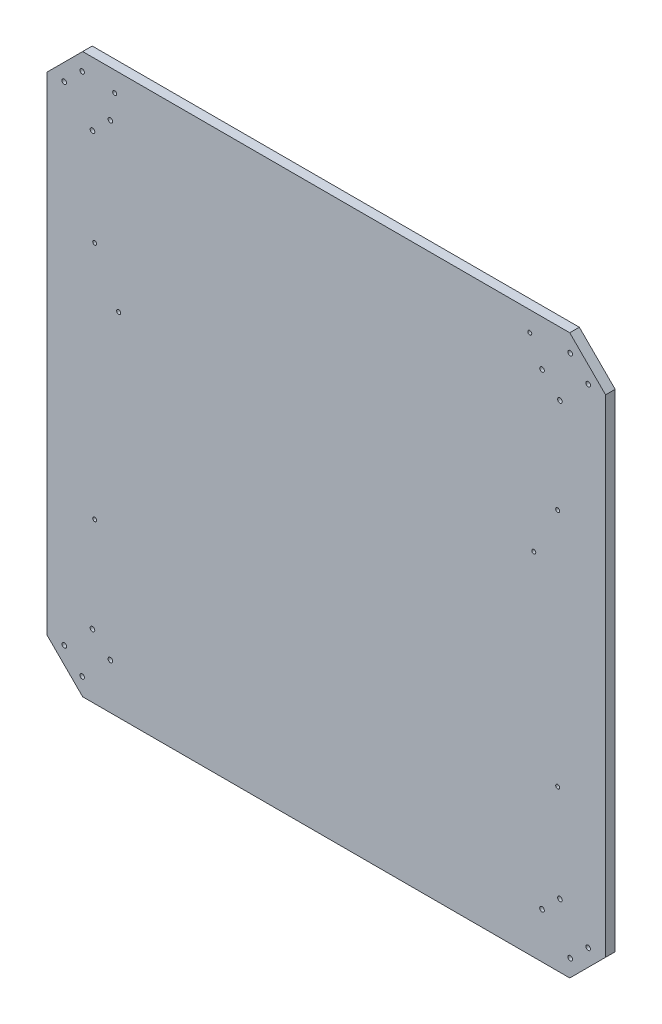
ISO-10303-21;
HEADER;
FILE_DESCRIPTION(('STEP AP214'),'2;1');
FILE_NAME('part.step','',(''),(''),'','','');
FILE_SCHEMA(('AUTOMOTIVE_DESIGN { 1 0 10303 214 1 1 1 1 }'));
ENDSEC;
DATA;
#1=APPLICATION_CONTEXT('core data for automotive mechanical design processes');
#2=APPLICATION_PROTOCOL_DEFINITION('international standard','automotive_design',2000,#1);
#3=PRODUCT_CONTEXT('',#1,'mechanical');
#4=PRODUCT('Part','Part','',(#3));
#5=PRODUCT_RELATED_PRODUCT_CATEGORY('part','',(#4));
#6=PRODUCT_DEFINITION_FORMATION('','',#4);
#7=PRODUCT_DEFINITION_CONTEXT('part definition',#1,'design');
#8=PRODUCT_DEFINITION('design','',#6,#7);
#9=PRODUCT_DEFINITION_SHAPE('','',#8);
#10=(LENGTH_UNIT() NAMED_UNIT(*) SI_UNIT(.MILLI.,.METRE.));
#11=(NAMED_UNIT(*) PLANE_ANGLE_UNIT() SI_UNIT($,.RADIAN.));
#12=(NAMED_UNIT(*) SI_UNIT($,.STERADIAN.) SOLID_ANGLE_UNIT());
#13=UNCERTAINTY_MEASURE_WITH_UNIT(LENGTH_MEASURE(1.E-05),#10,'distance_accuracy_value','');
#14=(GEOMETRIC_REPRESENTATION_CONTEXT(3) GLOBAL_UNCERTAINTY_ASSIGNED_CONTEXT((#13)) GLOBAL_UNIT_ASSIGNED_CONTEXT((#10,
#11,#12)) REPRESENTATION_CONTEXT('',''));
#15=CARTESIAN_POINT('',(0.,0.,0.));
#16=DIRECTION('',(0.,0.,1.));
#17=DIRECTION('',(1.,0.,0.));
#18=AXIS2_PLACEMENT_3D('',#15,#16,#17);
#19=CARTESIAN_POINT('',(350.,-350.,12.));
#20=DIRECTION('',(-1.,0.,0.));
#21=DIRECTION('',(0.,0.,1.));
#22=AXIS2_PLACEMENT_3D('',#19,#20,#21);
#23=PLANE('',#22);
#24=DIRECTION('',(0.,1.,0.));
#25=VECTOR('',#24,1.);
#26=CARTESIAN_POINT('',(350.,-350.,12.));
#27=LINE('',#26,#25);
#28=CARTESIAN_POINT('',(350.,-305.098719394654,12.));
#29=VERTEX_POINT('',#28);
#30=CARTESIAN_POINT('',(350.,305.098719394654,12.));
#31=VERTEX_POINT('',#30);
#32=EDGE_CURVE('E138',#29,#31,#27,.T.);
#33=ORIENTED_EDGE('',*,*,#32,.F.);
#34=DIRECTION('',(0.,0.,1.));
#35=VECTOR('',#34,1.);
#36=CARTESIAN_POINT('',(350.,-305.098719394654,0.));
#37=LINE('',#36,#35);
#38=CARTESIAN_POINT('',(350.,-305.098719394654,0.));
#39=VERTEX_POINT('',#38);
#40=EDGE_CURVE('E263',#39,#29,#37,.T.);
#41=ORIENTED_EDGE('',*,*,#40,.F.);
#42=DIRECTION('',(0.,1.,0.));
#43=VECTOR('',#42,1.);
#44=CARTESIAN_POINT('',(350.,-350.,0.));
#45=LINE('',#44,#43);
#46=CARTESIAN_POINT('',(350.,305.098719394654,0.));
#47=VERTEX_POINT('',#46);
#48=EDGE_CURVE('E288',#39,#47,#45,.T.);
#49=ORIENTED_EDGE('',*,*,#48,.T.);
#50=DIRECTION('',(0.,0.,1.));
#51=VECTOR('',#50,1.);
#52=CARTESIAN_POINT('',(350.,305.098719394654,0.));
#53=LINE('',#52,#51);
#54=EDGE_CURVE('E285',#47,#31,#53,.T.);
#55=ORIENTED_EDGE('',*,*,#54,.T.);
#56=EDGE_LOOP('',(#33,#41,#49,#55));
#57=FACE_BOUND('',#56,.T.);
#58=ADVANCED_FACE('F52',(#57),#23,.F.);
#59=CARTESIAN_POINT('',(-350.,350.,12.));
#60=DIRECTION('',(0.,-1.,0.));
#61=DIRECTION('',(0.,0.,-1.));
#62=AXIS2_PLACEMENT_3D('',#59,#60,#61);
#63=PLANE('',#62);
#64=DIRECTION('',(-1.,0.,0.));
#65=VECTOR('',#64,1.);
#66=CARTESIAN_POINT('',(-350.,350.,0.));
#67=LINE('',#66,#65);
#68=CARTESIAN_POINT('',(305.098719394654,350.,0.));
#69=VERTEX_POINT('',#68);
#70=CARTESIAN_POINT('',(-305.098719394654,350.,0.));
#71=VERTEX_POINT('',#70);
#72=EDGE_CURVE('E144',#69,#71,#67,.T.);
#73=ORIENTED_EDGE('',*,*,#72,.T.);
#74=DIRECTION('',(0.,0.,1.));
#75=VECTOR('',#74,1.);
#76=CARTESIAN_POINT('',(-305.098719394654,350.,0.));
#77=LINE('',#76,#75);
#78=CARTESIAN_POINT('',(-305.098719394654,350.,12.));
#79=VERTEX_POINT('',#78);
#80=EDGE_CURVE('E68',#71,#79,#77,.T.);
#81=ORIENTED_EDGE('',*,*,#80,.T.);
#82=DIRECTION('',(-1.,0.,0.));
#83=VECTOR('',#82,1.);
#84=CARTESIAN_POINT('',(-350.,350.,12.));
#85=LINE('',#84,#83);
#86=CARTESIAN_POINT('',(305.098719394654,350.,12.));
#87=VERTEX_POINT('',#86);
#88=EDGE_CURVE('E142',#87,#79,#85,.T.);
#89=ORIENTED_EDGE('',*,*,#88,.F.);
#90=DIRECTION('',(0.,0.,1.));
#91=VECTOR('',#90,1.);
#92=CARTESIAN_POINT('',(305.098719394654,350.,0.));
#93=LINE('',#92,#91);
#94=EDGE_CURVE('E283',#69,#87,#93,.T.);
#95=ORIENTED_EDGE('',*,*,#94,.F.);
#96=EDGE_LOOP('',(#73,#81,#89,#95));
#97=FACE_BOUND('',#96,.T.);
#98=ADVANCED_FACE('F299',(#97),#63,.F.);
#99=CARTESIAN_POINT('',(-350.,-350.,12.));
#100=DIRECTION('',(1.,0.,0.));
#101=DIRECTION('',(0.,0.,-1.));
#102=AXIS2_PLACEMENT_3D('',#99,#100,#101);
#103=PLANE('',#102);
#104=DIRECTION('',(0.,-1.,0.));
#105=VECTOR('',#104,1.);
#106=CARTESIAN_POINT('',(-350.,-350.,0.));
#107=LINE('',#106,#105);
#108=CARTESIAN_POINT('',(-350.,305.098719394654,0.));
#109=VERTEX_POINT('',#108);
#110=CARTESIAN_POINT('',(-350.,-305.098719394654,0.));
#111=VERTEX_POINT('',#110);
#112=EDGE_CURVE('E139',#109,#111,#107,.T.);
#113=ORIENTED_EDGE('',*,*,#112,.T.);
#114=DIRECTION('',(0.,0.,1.));
#115=VECTOR('',#114,1.);
#116=CARTESIAN_POINT('',(-350.,-305.098719394654,0.));
#117=LINE('',#116,#115);
#118=CARTESIAN_POINT('',(-350.,-305.098719394654,12.));
#119=VERTEX_POINT('',#118);
#120=EDGE_CURVE('E76',#111,#119,#117,.T.);
#121=ORIENTED_EDGE('',*,*,#120,.T.);
#122=DIRECTION('',(0.,-1.,0.));
#123=VECTOR('',#122,1.);
#124=CARTESIAN_POINT('',(-350.,-350.,12.));
#125=LINE('',#124,#123);
#126=CARTESIAN_POINT('',(-350.,305.098719394654,12.));
#127=VERTEX_POINT('',#126);
#128=EDGE_CURVE('E60',#127,#119,#125,.T.);
#129=ORIENTED_EDGE('',*,*,#128,.F.);
#130=DIRECTION('',(0.,0.,1.));
#131=VECTOR('',#130,1.);
#132=CARTESIAN_POINT('',(-350.,305.098719394654,0.));
#133=LINE('',#132,#131);
#134=EDGE_CURVE('E270',#109,#127,#133,.T.);
#135=ORIENTED_EDGE('',*,*,#134,.F.);
#136=EDGE_LOOP('',(#113,#121,#129,#135));
#137=FACE_BOUND('',#136,.T.);
#138=ADVANCED_FACE('F306',(#137),#103,.F.);
#139=CARTESIAN_POINT('',(-350.,-350.,12.));
#140=DIRECTION('',(0.,1.,0.));
#141=DIRECTION('',(0.,0.,1.));
#142=AXIS2_PLACEMENT_3D('',#139,#140,#141);
#143=PLANE('',#142);
#144=DIRECTION('',(1.,0.,0.));
#145=VECTOR('',#144,1.);
#146=CARTESIAN_POINT('',(-350.,-350.,12.));
#147=LINE('',#146,#145);
#148=CARTESIAN_POINT('',(-305.098719394654,-350.,12.));
#149=VERTEX_POINT('',#148);
#150=CARTESIAN_POINT('',(305.098719394654,-350.,12.));
#151=VERTEX_POINT('',#150);
#152=EDGE_CURVE('E13',#149,#151,#147,.T.);
#153=ORIENTED_EDGE('',*,*,#152,.F.);
#154=DIRECTION('',(0.,0.,1.));
#155=VECTOR('',#154,1.);
#156=CARTESIAN_POINT('',(-305.098719394654,-350.,0.));
#157=LINE('',#156,#155);
#158=CARTESIAN_POINT('',(-305.098719394654,-350.,0.));
#159=VERTEX_POINT('',#158);
#160=EDGE_CURVE('E118',#159,#149,#157,.T.);
#161=ORIENTED_EDGE('',*,*,#160,.F.);
#162=DIRECTION('',(1.,0.,0.));
#163=VECTOR('',#162,1.);
#164=CARTESIAN_POINT('',(-350.,-350.,0.));
#165=LINE('',#164,#163);
#166=CARTESIAN_POINT('',(305.098719394654,-350.,0.));
#167=VERTEX_POINT('',#166);
#168=EDGE_CURVE('E131',#159,#167,#165,.T.);
#169=ORIENTED_EDGE('',*,*,#168,.T.);
#170=DIRECTION('',(0.,0.,1.));
#171=VECTOR('',#170,1.);
#172=CARTESIAN_POINT('',(305.098719394654,-350.,0.));
#173=LINE('',#172,#171);
#174=EDGE_CURVE('E259',#167,#151,#173,.T.);
#175=ORIENTED_EDGE('',*,*,#174,.T.);
#176=EDGE_LOOP('',(#153,#161,#169,#175));
#177=FACE_BOUND('',#176,.T.);
#178=ADVANCED_FACE('F129',(#177),#143,.F.);
#179=CARTESIAN_POINT('',(0.,0.,12.));
#180=DIRECTION('',(0.,0.,-1.));
#181=DIRECTION('',(-1.,0.,0.));
#182=AXIS2_PLACEMENT_3D('',#179,#180,#181);
#183=PLANE('',#182);
#184=CARTESIAN_POINT('',(290.,150.,12.));
#185=DIRECTION('',(0.,0.,1.));
#186=DIRECTION('',(-1.,0.,0.));
#187=AXIS2_PLACEMENT_3D('',#184,#185,#186);
#188=CIRCLE('',#187,2.50000000000002);
#189=CARTESIAN_POINT('',(287.5,150.,12.));
#190=VERTEX_POINT('',#189);
#191=EDGE_CURVE('E387',#190,#190,#188,.T.);
#192=ORIENTED_EDGE('',*,*,#191,.F.);
#193=EDGE_LOOP('',(#192));
#194=FACE_BOUND('',#193,.T.);
#195=CARTESIAN_POINT('',(290.,-150.,12.));
#196=DIRECTION('',(0.,0.,1.));
#197=DIRECTION('',(1.,0.,0.));
#198=AXIS2_PLACEMENT_3D('',#195,#196,#197);
#199=CIRCLE('',#198,2.50000000000002);
#200=CARTESIAN_POINT('',(292.5,-150.,12.));
#201=VERTEX_POINT('',#200);
#202=EDGE_CURVE('E395',#201,#201,#199,.T.);
#203=ORIENTED_EDGE('',*,*,#202,.F.);
#204=EDGE_LOOP('',(#203));
#205=FACE_BOUND('',#204,.T.);
#206=CARTESIAN_POINT('',(-290.,-150.,12.));
#207=DIRECTION('',(0.,0.,1.));
#208=DIRECTION('',(-1.,0.,0.));
#209=AXIS2_PLACEMENT_3D('',#206,#207,#208);
#210=CIRCLE('',#209,2.50000000000002);
#211=CARTESIAN_POINT('',(-292.5,-150.,12.));
#212=VERTEX_POINT('',#211);
#213=EDGE_CURVE('E391',#212,#212,#210,.T.);
#214=ORIENTED_EDGE('',*,*,#213,.F.);
#215=EDGE_LOOP('',(#214));
#216=FACE_BOUND('',#215,.T.);
#217=CARTESIAN_POINT('',(-260.,90.,12.));
#218=DIRECTION('',(0.,0.,1.));
#219=DIRECTION('',(1.,0.,0.));
#220=AXIS2_PLACEMENT_3D('',#217,#218,#219);
#221=CIRCLE('',#220,2.50000000000002);
#222=CARTESIAN_POINT('',(-257.5,90.,12.));
#223=VERTEX_POINT('',#222);
#224=EDGE_CURVE('E388',#223,#223,#221,.T.);
#225=ORIENTED_EDGE('',*,*,#224,.F.);
#226=EDGE_LOOP('',(#225));
#227=FACE_BOUND('',#226,.T.);
#228=CARTESIAN_POINT('',(255.,325.,12.));
#229=DIRECTION('',(0.,0.,1.));
#230=DIRECTION('',(-1.,0.,0.));
#231=AXIS2_PLACEMENT_3D('',#228,#229,#230);
#232=CIRCLE('',#231,2.50000000000002);
#233=CARTESIAN_POINT('',(252.5,325.,12.));
#234=VERTEX_POINT('',#233);
#235=EDGE_CURVE('E403',#234,#234,#232,.T.);
#236=ORIENTED_EDGE('',*,*,#235,.F.);
#237=EDGE_LOOP('',(#236));
#238=FACE_BOUND('',#237,.T.);
#239=CARTESIAN_POINT('',(-265.,325.,12.));
#240=DIRECTION('',(0.,0.,1.));
#241=DIRECTION('',(1.,0.,0.));
#242=AXIS2_PLACEMENT_3D('',#239,#240,#241);
#243=CIRCLE('',#242,2.50000000000002);
#244=CARTESIAN_POINT('',(-262.5,325.,12.));
#245=VERTEX_POINT('',#244);
#246=EDGE_CURVE('E400',#245,#245,#243,.T.);
#247=ORIENTED_EDGE('',*,*,#246,.F.);
#248=EDGE_LOOP('',(#247));
#249=FACE_BOUND('',#248,.T.);
#250=CARTESIAN_POINT('',(260.,90.,12.));
#251=DIRECTION('',(0.,0.,1.));
#252=DIRECTION('',(-1.,0.,0.));
#253=AXIS2_PLACEMENT_3D('',#250,#251,#252);
#254=CIRCLE('',#253,2.50000000000002);
#255=CARTESIAN_POINT('',(257.5,90.,12.));
#256=VERTEX_POINT('',#255);
#257=EDGE_CURVE('E392',#256,#256,#254,.T.);
#258=ORIENTED_EDGE('',*,*,#257,.F.);
#259=EDGE_LOOP('',(#258));
#260=FACE_BOUND('',#259,.T.);
#261=CARTESIAN_POINT('',(-290.,150.,12.));
#262=DIRECTION('',(0.,0.,1.));
#263=DIRECTION('',(1.,0.,0.));
#264=AXIS2_PLACEMENT_3D('',#261,#262,#263);
#265=CIRCLE('',#264,2.50000000000002);
#266=CARTESIAN_POINT('',(-287.5,150.,12.));
#267=VERTEX_POINT('',#266);
#268=EDGE_CURVE('E152',#267,#267,#265,.T.);
#269=ORIENTED_EDGE('',*,*,#268,.F.);
#270=EDGE_LOOP('',(#269));
#271=FACE_BOUND('',#270,.T.);
#272=CARTESIAN_POINT('',(270.362098768865,-292.812739071538,12.));
#273=DIRECTION('',(0.,0.,1.));
#274=DIRECTION('',(1.,0.,0.));
#275=AXIS2_PLACEMENT_3D('',#272,#273,#274);
#276=CIRCLE('',#275,2.89155053314971);
#277=CARTESIAN_POINT('',(273.253649302015,-292.812739071538,12.));
#278=VERTEX_POINT('',#277);
#279=EDGE_CURVE('E187',#278,#278,#276,.T.);
#280=ORIENTED_EDGE('',*,*,#279,.F.);
#281=EDGE_LOOP('',(#280));
#282=FACE_BOUND('',#281,.T.);
#283=CARTESIAN_POINT('',(-328.168078130865,305.717437828192,12.));
#284=DIRECTION('',(0.,0.,1.));
#285=DIRECTION('',(1.,0.,0.));
#286=AXIS2_PLACEMENT_3D('',#283,#284,#285);
#287=CIRCLE('',#286,2.89155053314971);
#288=CARTESIAN_POINT('',(-325.276527597716,305.717437828192,12.));
#289=VERTEX_POINT('',#288);
#290=EDGE_CURVE('E214',#289,#289,#287,.T.);
#291=ORIENTED_EDGE('',*,*,#290,.F.);
#292=EDGE_LOOP('',(#291));
#293=FACE_BOUND('',#292,.T.);
#294=CARTESIAN_POINT('',(-305.717437828193,328.168078130865,12.));
#295=DIRECTION('',(0.,0.,1.));
#296=DIRECTION('',(-1.,0.,0.));
#297=AXIS2_PLACEMENT_3D('',#294,#295,#296);
#298=CIRCLE('',#297,2.89155053314971);
#299=CARTESIAN_POINT('',(-308.608988361342,328.168078130865,12.));
#300=VERTEX_POINT('',#299);
#301=EDGE_CURVE('E213',#300,#300,#298,.T.);
#302=ORIENTED_EDGE('',*,*,#301,.F.);
#303=EDGE_LOOP('',(#302));
#304=FACE_BOUND('',#303,.T.);
#305=CARTESIAN_POINT('',(-292.812739071538,270.362098768865,12.));
#306=DIRECTION('',(0.,0.,1.));
#307=DIRECTION('',(-1.,0.,0.));
#308=AXIS2_PLACEMENT_3D('',#305,#306,#307);
#309=CIRCLE('',#308,2.89155053314971);
#310=CARTESIAN_POINT('',(-295.704289604688,270.362098768865,12.));
#311=VERTEX_POINT('',#310);
#312=EDGE_CURVE('E226',#311,#311,#309,.T.);
#313=ORIENTED_EDGE('',*,*,#312,.F.);
#314=EDGE_LOOP('',(#313));
#315=FACE_BOUND('',#314,.T.);
#316=CARTESIAN_POINT('',(305.717437828193,-328.168078130865,12.));
#317=DIRECTION('',(0.,0.,1.));
#318=DIRECTION('',(-1.,0.,0.));
#319=AXIS2_PLACEMENT_3D('',#316,#317,#318);
#320=CIRCLE('',#319,2.89155053314971);
#321=CARTESIAN_POINT('',(302.825887295043,-328.168078130865,12.));
#322=VERTEX_POINT('',#321);
#323=EDGE_CURVE('E188',#322,#322,#320,.T.);
#324=ORIENTED_EDGE('',*,*,#323,.F.);
#325=EDGE_LOOP('',(#324));
#326=FACE_BOUND('',#325,.T.);
#327=CARTESIAN_POINT('',(328.168078130865,-305.717437828192,12.));
#328=DIRECTION('',(0.,0.,1.));
#329=DIRECTION('',(1.,0.,0.));
#330=AXIS2_PLACEMENT_3D('',#327,#328,#329);
#331=CIRCLE('',#330,2.89155053314971);
#332=CARTESIAN_POINT('',(331.059628664015,-305.717437828192,12.));
#333=VERTEX_POINT('',#332);
#334=EDGE_CURVE('E194',#333,#333,#331,.T.);
#335=ORIENTED_EDGE('',*,*,#334,.F.);
#336=EDGE_LOOP('',(#335));
#337=FACE_BOUND('',#336,.T.);
#338=CARTESIAN_POINT('',(292.812739071538,-270.362098768865,12.));
#339=DIRECTION('',(0.,0.,1.));
#340=DIRECTION('',(-1.,0.,0.));
#341=AXIS2_PLACEMENT_3D('',#338,#339,#340);
#342=CIRCLE('',#341,2.89155053314971);
#343=CARTESIAN_POINT('',(289.921188538388,-270.362098768865,12.));
#344=VERTEX_POINT('',#343);
#345=EDGE_CURVE('E200',#344,#344,#342,.T.);
#346=ORIENTED_EDGE('',*,*,#345,.F.);
#347=EDGE_LOOP('',(#346));
#348=FACE_BOUND('',#347,.T.);
#349=CARTESIAN_POINT('',(-270.362098768865,-292.812739071538,12.));
#350=DIRECTION('',(0.,0.,1.));
#351=DIRECTION('',(-1.,0.,0.));
#352=AXIS2_PLACEMENT_3D('',#349,#350,#351);
#353=CIRCLE('',#352,2.89155053314971);
#354=CARTESIAN_POINT('',(-273.253649302015,-292.812739071538,12.));
#355=VERTEX_POINT('',#354);
#356=EDGE_CURVE('E206',#355,#355,#353,.T.);
#357=ORIENTED_EDGE('',*,*,#356,.F.);
#358=EDGE_LOOP('',(#357));
#359=FACE_BOUND('',#358,.T.);
#360=CARTESIAN_POINT('',(305.717437828193,328.168078130865,12.));
#361=DIRECTION('',(0.,0.,1.));
#362=DIRECTION('',(1.,0.,0.));
#363=AXIS2_PLACEMENT_3D('',#360,#361,#362);
#364=CIRCLE('',#363,2.89155053314971);
#365=CARTESIAN_POINT('',(308.608988361342,328.168078130865,12.));
#366=VERTEX_POINT('',#365);
#367=EDGE_CURVE('E237',#366,#366,#364,.T.);
#368=ORIENTED_EDGE('',*,*,#367,.F.);
#369=EDGE_LOOP('',(#368));
#370=FACE_BOUND('',#369,.T.);
#371=CARTESIAN_POINT('',(328.168078130865,305.717437828192,12.));
#372=DIRECTION('',(0.,0.,1.));
#373=DIRECTION('',(-1.,0.,0.));
#374=AXIS2_PLACEMENT_3D('',#371,#372,#373);
#375=CIRCLE('',#374,2.89155053314971);
#376=CARTESIAN_POINT('',(325.276527597716,305.717437828192,12.));
#377=VERTEX_POINT('',#376);
#378=EDGE_CURVE('E238',#377,#377,#375,.T.);
#379=ORIENTED_EDGE('',*,*,#378,.F.);
#380=EDGE_LOOP('',(#379));
#381=FACE_BOUND('',#380,.T.);
#382=CARTESIAN_POINT('',(292.812739071538,270.362098768865,12.));
#383=DIRECTION('',(0.,0.,1.));
#384=DIRECTION('',(1.,0.,0.));
#385=AXIS2_PLACEMENT_3D('',#382,#383,#384);
#386=CIRCLE('',#385,2.89155053314971);
#387=CARTESIAN_POINT('',(295.704289604688,270.362098768865,12.));
#388=VERTEX_POINT('',#387);
#389=EDGE_CURVE('E244',#388,#388,#386,.T.);
#390=ORIENTED_EDGE('',*,*,#389,.F.);
#391=EDGE_LOOP('',(#390));
#392=FACE_BOUND('',#391,.T.);
#393=CARTESIAN_POINT('',(270.362098768865,292.812739071538,12.));
#394=DIRECTION('',(0.,0.,1.));
#395=DIRECTION('',(-1.,0.,0.));
#396=AXIS2_PLACEMENT_3D('',#393,#394,#395);
#397=CIRCLE('',#396,2.89155053314971);
#398=CARTESIAN_POINT('',(267.470548235715,292.812739071538,12.));
#399=VERTEX_POINT('',#398);
#400=EDGE_CURVE('E250',#399,#399,#397,.T.);
#401=ORIENTED_EDGE('',*,*,#400,.F.);
#402=EDGE_LOOP('',(#401));
#403=FACE_BOUND('',#402,.T.);
#404=CARTESIAN_POINT('',(-270.362098768865,292.812739071538,12.));
#405=DIRECTION('',(0.,0.,1.));
#406=DIRECTION('',(1.,0.,0.));
#407=AXIS2_PLACEMENT_3D('',#404,#405,#406);
#408=CIRCLE('',#407,2.89155053314971);
#409=CARTESIAN_POINT('',(-267.470548235715,292.812739071538,12.));
#410=VERTEX_POINT('',#409);
#411=EDGE_CURVE('E225',#410,#410,#408,.T.);
#412=ORIENTED_EDGE('',*,*,#411,.F.);
#413=EDGE_LOOP('',(#412));
#414=FACE_BOUND('',#413,.T.);
#415=CARTESIAN_POINT('',(-292.812739071538,-270.362098768865,12.));
#416=DIRECTION('',(0.,0.,1.));
#417=DIRECTION('',(1.,0.,0.));
#418=AXIS2_PLACEMENT_3D('',#415,#416,#417);
#419=CIRCLE('',#418,2.89155053314971);
#420=CARTESIAN_POINT('',(-289.921188538388,-270.362098768865,12.));
#421=VERTEX_POINT('',#420);
#422=EDGE_CURVE('E373',#421,#421,#419,.T.);
#423=ORIENTED_EDGE('',*,*,#422,.F.);
#424=EDGE_LOOP('',(#423));
#425=FACE_BOUND('',#424,.T.);
#426=CARTESIAN_POINT('',(-305.717437828193,-328.168078130865,12.));
#427=DIRECTION('',(0.,0.,1.));
#428=DIRECTION('',(1.,0.,0.));
#429=AXIS2_PLACEMENT_3D('',#426,#427,#428);
#430=CIRCLE('',#429,2.89155053314971);
#431=CARTESIAN_POINT('',(-302.825887295043,-328.168078130865,12.));
#432=VERTEX_POINT('',#431);
#433=EDGE_CURVE('E180',#432,#432,#430,.T.);
#434=ORIENTED_EDGE('',*,*,#433,.F.);
#435=EDGE_LOOP('',(#434));
#436=FACE_BOUND('',#435,.T.);
#437=CARTESIAN_POINT('',(-328.168078130865,-305.717437828192,12.));
#438=DIRECTION('',(0.,0.,1.));
#439=DIRECTION('',(-1.,0.,0.));
#440=AXIS2_PLACEMENT_3D('',#437,#438,#439);
#441=CIRCLE('',#440,2.89155053314971);
#442=CARTESIAN_POINT('',(-331.059628664015,-305.717437828192,12.));
#443=VERTEX_POINT('',#442);
#444=EDGE_CURVE('E171',#443,#443,#441,.T.);
#445=ORIENTED_EDGE('',*,*,#444,.F.);
#446=EDGE_LOOP('',(#445));
#447=FACE_BOUND('',#446,.T.);
#448=ORIENTED_EDGE('',*,*,#128,.T.);
#449=DIRECTION('',(-0.707106781186548,0.707106781186548,0.));
#450=VECTOR('',#449,1.);
#451=CARTESIAN_POINT('',(-305.098719394654,-350.,12.));
#452=LINE('',#451,#450);
#453=EDGE_CURVE('E124',#149,#119,#452,.T.);
#454=ORIENTED_EDGE('',*,*,#453,.F.);
#455=ORIENTED_EDGE('',*,*,#152,.T.);
#456=DIRECTION('',(-0.707106781186548,-0.707106781186548,0.));
#457=VECTOR('',#456,1.);
#458=CARTESIAN_POINT('',(305.098719394654,-350.,12.));
#459=LINE('',#458,#457);
#460=EDGE_CURVE('E264',#29,#151,#459,.T.);
#461=ORIENTED_EDGE('',*,*,#460,.F.);
#462=ORIENTED_EDGE('',*,*,#32,.T.);
#463=DIRECTION('',(0.707106781186548,-0.707106781186548,0.));
#464=VECTOR('',#463,1.);
#465=CARTESIAN_POINT('',(305.098719394654,350.,12.));
#466=LINE('',#465,#464);
#467=EDGE_CURVE('E260',#87,#31,#466,.T.);
#468=ORIENTED_EDGE('',*,*,#467,.F.);
#469=ORIENTED_EDGE('',*,*,#88,.T.);
#470=DIRECTION('',(0.707106781186548,0.707106781186548,0.));
#471=VECTOR('',#470,1.);
#472=CARTESIAN_POINT('',(-305.098719394654,350.,12.));
#473=LINE('',#472,#471);
#474=EDGE_CURVE('E271',#127,#79,#473,.T.);
#475=ORIENTED_EDGE('',*,*,#474,.F.);
#476=EDGE_LOOP('',(#448,#454,#455,#461,#462,#468,#469,#475));
#477=FACE_BOUND('',#476,.T.);
#478=ADVANCED_FACE('F308',(#194,#205,#216,#227,#238,#249,#260,#271,#282,#293,#304,#315,#326,
#337,#348,#359,#370,#381,#392,#403,#414,#425,#436,#447,#477),#183,.F.);
#479=CARTESIAN_POINT('',(0.,0.,0.));
#480=DIRECTION('',(0.,0.,-1.));
#481=DIRECTION('',(-1.,0.,0.));
#482=AXIS2_PLACEMENT_3D('',#479,#480,#481);
#483=PLANE('',#482);
#484=CARTESIAN_POINT('',(290.,150.,0.));
#485=DIRECTION('',(0.,0.,-1.));
#486=DIRECTION('',(-1.,0.,0.));
#487=AXIS2_PLACEMENT_3D('',#484,#485,#486);
#488=CIRCLE('',#487,2.50000000000002);
#489=CARTESIAN_POINT('',(287.5,150.,0.));
#490=VERTEX_POINT('',#489);
#491=EDGE_CURVE('E55',#490,#490,#488,.T.);
#492=ORIENTED_EDGE('',*,*,#491,.F.);
#493=EDGE_LOOP('',(#492));
#494=FACE_BOUND('',#493,.T.);
#495=CARTESIAN_POINT('',(290.,-150.,0.));
#496=DIRECTION('',(0.,0.,-1.));
#497=DIRECTION('',(-1.,0.,0.));
#498=AXIS2_PLACEMENT_3D('',#495,#496,#497);
#499=CIRCLE('',#498,2.50000000000002);
#500=CARTESIAN_POINT('',(287.5,-150.,0.));
#501=VERTEX_POINT('',#500);
#502=EDGE_CURVE('E166',#501,#501,#499,.T.);
#503=ORIENTED_EDGE('',*,*,#502,.F.);
#504=EDGE_LOOP('',(#503));
#505=FACE_BOUND('',#504,.T.);
#506=CARTESIAN_POINT('',(-290.,-150.,0.));
#507=DIRECTION('',(0.,0.,-1.));
#508=DIRECTION('',(-1.,0.,0.));
#509=AXIS2_PLACEMENT_3D('',#506,#507,#508);
#510=CIRCLE('',#509,2.50000000000002);
#511=CARTESIAN_POINT('',(-292.5,-150.,0.));
#512=VERTEX_POINT('',#511);
#513=EDGE_CURVE('E164',#512,#512,#510,.T.);
#514=ORIENTED_EDGE('',*,*,#513,.F.);
#515=EDGE_LOOP('',(#514));
#516=FACE_BOUND('',#515,.T.);
#517=CARTESIAN_POINT('',(-260.,90.,0.));
#518=DIRECTION('',(0.,0.,-1.));
#519=DIRECTION('',(-1.,0.,0.));
#520=AXIS2_PLACEMENT_3D('',#517,#518,#519);
#521=CIRCLE('',#520,2.50000000000002);
#522=CARTESIAN_POINT('',(-262.5,90.,0.));
#523=VERTEX_POINT('',#522);
#524=EDGE_CURVE('E161',#523,#523,#521,.T.);
#525=ORIENTED_EDGE('',*,*,#524,.F.);
#526=EDGE_LOOP('',(#525));
#527=FACE_BOUND('',#526,.T.);
#528=CARTESIAN_POINT('',(255.,325.,0.));
#529=DIRECTION('',(0.,0.,-1.));
#530=DIRECTION('',(-1.,0.,0.));
#531=AXIS2_PLACEMENT_3D('',#528,#529,#530);
#532=CIRCLE('',#531,2.50000000000002);
#533=CARTESIAN_POINT('',(252.5,325.,0.));
#534=VERTEX_POINT('',#533);
#535=EDGE_CURVE('E158',#534,#534,#532,.T.);
#536=ORIENTED_EDGE('',*,*,#535,.F.);
#537=EDGE_LOOP('',(#536));
#538=FACE_BOUND('',#537,.T.);
#539=CARTESIAN_POINT('',(-265.,325.,0.));
#540=DIRECTION('',(0.,0.,-1.));
#541=DIRECTION('',(-1.,0.,0.));
#542=AXIS2_PLACEMENT_3D('',#539,#540,#541);
#543=CIRCLE('',#542,2.50000000000002);
#544=CARTESIAN_POINT('',(-267.5,325.,0.));
#545=VERTEX_POINT('',#544);
#546=EDGE_CURVE('E155',#545,#545,#543,.T.);
#547=ORIENTED_EDGE('',*,*,#546,.F.);
#548=EDGE_LOOP('',(#547));
#549=FACE_BOUND('',#548,.T.);
#550=CARTESIAN_POINT('',(260.,90.,0.));
#551=DIRECTION('',(0.,0.,-1.));
#552=DIRECTION('',(-1.,0.,0.));
#553=AXIS2_PLACEMENT_3D('',#550,#551,#552);
#554=CIRCLE('',#553,2.50000000000002);
#555=CARTESIAN_POINT('',(257.5,90.,0.));
#556=VERTEX_POINT('',#555);
#557=EDGE_CURVE('E151',#556,#556,#554,.T.);
#558=ORIENTED_EDGE('',*,*,#557,.F.);
#559=EDGE_LOOP('',(#558));
#560=FACE_BOUND('',#559,.T.);
#561=CARTESIAN_POINT('',(-290.,150.,0.));
#562=DIRECTION('',(0.,0.,-1.));
#563=DIRECTION('',(-1.,0.,0.));
#564=AXIS2_PLACEMENT_3D('',#561,#562,#563);
#565=CIRCLE('',#564,2.50000000000002);
#566=CARTESIAN_POINT('',(-292.5,150.,0.));
#567=VERTEX_POINT('',#566);
#568=EDGE_CURVE('E148',#567,#567,#565,.T.);
#569=ORIENTED_EDGE('',*,*,#568,.F.);
#570=EDGE_LOOP('',(#569));
#571=FACE_BOUND('',#570,.T.);
#572=CARTESIAN_POINT('',(270.362098768865,-292.812739071538,0.));
#573=DIRECTION('',(0.,0.,1.));
#574=DIRECTION('',(1.,0.,0.));
#575=AXIS2_PLACEMENT_3D('',#572,#573,#574);
#576=CIRCLE('',#575,2.89155053314971);
#577=CARTESIAN_POINT('',(273.253649302015,-292.812739071538,0.));
#578=VERTEX_POINT('',#577);
#579=EDGE_CURVE('E217',#578,#578,#576,.T.);
#580=ORIENTED_EDGE('',*,*,#579,.T.);
#581=EDGE_LOOP('',(#580));
#582=FACE_BOUND('',#581,.T.);
#583=CARTESIAN_POINT('',(-328.168078130865,305.717437828192,0.));
#584=DIRECTION('',(0.,0.,1.));
#585=DIRECTION('',(1.,0.,0.));
#586=AXIS2_PLACEMENT_3D('',#583,#584,#585);
#587=CIRCLE('',#586,2.89155053314971);
#588=CARTESIAN_POINT('',(-325.276527597716,305.717437828192,0.));
#589=VERTEX_POINT('',#588);
#590=EDGE_CURVE('E210',#589,#589,#587,.T.);
#591=ORIENTED_EDGE('',*,*,#590,.T.);
#592=EDGE_LOOP('',(#591));
#593=FACE_BOUND('',#592,.T.);
#594=CARTESIAN_POINT('',(-305.717437828193,328.168078130865,0.));
#595=DIRECTION('',(0.,0.,1.));
#596=DIRECTION('',(-1.,0.,0.));
#597=AXIS2_PLACEMENT_3D('',#594,#595,#596);
#598=CIRCLE('',#597,2.89155053314971);
#599=CARTESIAN_POINT('',(-308.608988361342,328.168078130865,0.));
#600=VERTEX_POINT('',#599);
#601=EDGE_CURVE('E229',#600,#600,#598,.T.);
#602=ORIENTED_EDGE('',*,*,#601,.T.);
#603=EDGE_LOOP('',(#602));
#604=FACE_BOUND('',#603,.T.);
#605=CARTESIAN_POINT('',(-292.812739071538,270.362098768865,0.));
#606=DIRECTION('',(0.,0.,1.));
#607=DIRECTION('',(-1.,0.,0.));
#608=AXIS2_PLACEMENT_3D('',#605,#606,#607);
#609=CIRCLE('',#608,2.89155053314971);
#610=CARTESIAN_POINT('',(-295.704289604688,270.362098768865,0.));
#611=VERTEX_POINT('',#610);
#612=EDGE_CURVE('E222',#611,#611,#609,.T.);
#613=ORIENTED_EDGE('',*,*,#612,.T.);
#614=EDGE_LOOP('',(#613));
#615=FACE_BOUND('',#614,.T.);
#616=CARTESIAN_POINT('',(305.717437828193,-328.168078130865,0.));
#617=DIRECTION('',(0.,0.,1.));
#618=DIRECTION('',(-1.,0.,0.));
#619=AXIS2_PLACEMENT_3D('',#616,#617,#618);
#620=CIRCLE('',#619,2.89155053314971);
#621=CARTESIAN_POINT('',(302.825887295043,-328.168078130865,0.));
#622=VERTEX_POINT('',#621);
#623=EDGE_CURVE('E184',#622,#622,#620,.T.);
#624=ORIENTED_EDGE('',*,*,#623,.T.);
#625=EDGE_LOOP('',(#624));
#626=FACE_BOUND('',#625,.T.);
#627=CARTESIAN_POINT('',(328.168078130865,-305.717437828192,0.));
#628=DIRECTION('',(0.,0.,1.));
#629=DIRECTION('',(1.,0.,0.));
#630=AXIS2_PLACEMENT_3D('',#627,#628,#629);
#631=CIRCLE('',#630,2.89155053314971);
#632=CARTESIAN_POINT('',(331.059628664015,-305.717437828192,0.));
#633=VERTEX_POINT('',#632);
#634=EDGE_CURVE('E191',#633,#633,#631,.T.);
#635=ORIENTED_EDGE('',*,*,#634,.T.);
#636=EDGE_LOOP('',(#635));
#637=FACE_BOUND('',#636,.T.);
#638=CARTESIAN_POINT('',(292.812739071538,-270.362098768865,0.));
#639=DIRECTION('',(0.,0.,1.));
#640=DIRECTION('',(-1.,0.,0.));
#641=AXIS2_PLACEMENT_3D('',#638,#639,#640);
#642=CIRCLE('',#641,2.89155053314971);
#643=CARTESIAN_POINT('',(289.921188538388,-270.362098768865,0.));
#644=VERTEX_POINT('',#643);
#645=EDGE_CURVE('E197',#644,#644,#642,.T.);
#646=ORIENTED_EDGE('',*,*,#645,.T.);
#647=EDGE_LOOP('',(#646));
#648=FACE_BOUND('',#647,.T.);
#649=CARTESIAN_POINT('',(-270.362098768865,-292.812739071538,0.));
#650=DIRECTION('',(0.,0.,1.));
#651=DIRECTION('',(-1.,0.,0.));
#652=AXIS2_PLACEMENT_3D('',#649,#650,#651);
#653=CIRCLE('',#652,2.89155053314971);
#654=CARTESIAN_POINT('',(-273.253649302015,-292.812739071538,0.));
#655=VERTEX_POINT('',#654);
#656=EDGE_CURVE('E203',#655,#655,#653,.T.);
#657=ORIENTED_EDGE('',*,*,#656,.T.);
#658=EDGE_LOOP('',(#657));
#659=FACE_BOUND('',#658,.T.);
#660=DIRECTION('',(-0.707106781186548,0.707106781186548,0.));
#661=VECTOR('',#660,1.);
#662=CARTESIAN_POINT('',(-305.098719394654,-350.,0.));
#663=LINE('',#662,#661);
#664=EDGE_CURVE('E115',#159,#111,#663,.T.);
#665=ORIENTED_EDGE('',*,*,#664,.T.);
#666=ORIENTED_EDGE('',*,*,#112,.F.);
#667=DIRECTION('',(0.707106781186548,0.707106781186548,0.));
#668=VECTOR('',#667,1.);
#669=CARTESIAN_POINT('',(-305.098719394654,350.,0.));
#670=LINE('',#669,#668);
#671=EDGE_CURVE('E268',#109,#71,#670,.T.);
#672=ORIENTED_EDGE('',*,*,#671,.T.);
#673=ORIENTED_EDGE('',*,*,#72,.F.);
#674=DIRECTION('',(0.707106781186548,-0.707106781186548,0.));
#675=VECTOR('',#674,1.);
#676=CARTESIAN_POINT('',(305.098719394654,350.,0.));
#677=LINE('',#676,#675);
#678=EDGE_CURVE('E280',#69,#47,#677,.T.);
#679=ORIENTED_EDGE('',*,*,#678,.T.);
#680=ORIENTED_EDGE('',*,*,#48,.F.);
#681=DIRECTION('',(-0.707106781186548,-0.707106781186548,0.));
#682=VECTOR('',#681,1.);
#683=CARTESIAN_POINT('',(305.098719394654,-350.,0.));
#684=LINE('',#683,#682);
#685=EDGE_CURVE('E137',#39,#167,#684,.T.);
#686=ORIENTED_EDGE('',*,*,#685,.T.);
#687=ORIENTED_EDGE('',*,*,#168,.F.);
#688=EDGE_LOOP('',(#665,#666,#672,#673,#679,#680,#686,#687));
#689=FACE_BOUND('',#688,.T.);
#690=CARTESIAN_POINT('',(305.717437828193,328.168078130865,0.));
#691=DIRECTION('',(0.,0.,1.));
#692=DIRECTION('',(1.,0.,0.));
#693=AXIS2_PLACEMENT_3D('',#690,#691,#692);
#694=CIRCLE('',#693,2.89155053314971);
#695=CARTESIAN_POINT('',(308.608988361342,328.168078130865,0.));
#696=VERTEX_POINT('',#695);
#697=EDGE_CURVE('E273',#696,#696,#694,.T.);
#698=ORIENTED_EDGE('',*,*,#697,.T.);
#699=EDGE_LOOP('',(#698));
#700=FACE_BOUND('',#699,.T.);
#701=CARTESIAN_POINT('',(328.168078130865,305.717437828192,0.));
#702=DIRECTION('',(0.,0.,1.));
#703=DIRECTION('',(-1.,0.,0.));
#704=AXIS2_PLACEMENT_3D('',#701,#702,#703);
#705=CIRCLE('',#704,2.89155053314971);
#706=CARTESIAN_POINT('',(325.276527597716,305.717437828192,0.));
#707=VERTEX_POINT('',#706);
#708=EDGE_CURVE('E234',#707,#707,#705,.T.);
#709=ORIENTED_EDGE('',*,*,#708,.T.);
#710=EDGE_LOOP('',(#709));
#711=FACE_BOUND('',#710,.T.);
#712=CARTESIAN_POINT('',(292.812739071538,270.362098768865,0.));
#713=DIRECTION('',(0.,0.,1.));
#714=DIRECTION('',(1.,0.,0.));
#715=AXIS2_PLACEMENT_3D('',#712,#713,#714);
#716=CIRCLE('',#715,2.89155053314971);
#717=CARTESIAN_POINT('',(295.704289604688,270.362098768865,0.));
#718=VERTEX_POINT('',#717);
#719=EDGE_CURVE('E241',#718,#718,#716,.T.);
#720=ORIENTED_EDGE('',*,*,#719,.T.);
#721=EDGE_LOOP('',(#720));
#722=FACE_BOUND('',#721,.T.);
#723=CARTESIAN_POINT('',(270.362098768865,292.812739071538,0.));
#724=DIRECTION('',(0.,0.,1.));
#725=DIRECTION('',(-1.,0.,0.));
#726=AXIS2_PLACEMENT_3D('',#723,#724,#725);
#727=CIRCLE('',#726,2.89155053314971);
#728=CARTESIAN_POINT('',(267.470548235715,292.812739071538,0.));
#729=VERTEX_POINT('',#728);
#730=EDGE_CURVE('E247',#729,#729,#727,.T.);
#731=ORIENTED_EDGE('',*,*,#730,.T.);
#732=EDGE_LOOP('',(#731));
#733=FACE_BOUND('',#732,.T.);
#734=CARTESIAN_POINT('',(-270.362098768865,292.812739071538,0.));
#735=DIRECTION('',(0.,0.,1.));
#736=DIRECTION('',(1.,0.,0.));
#737=AXIS2_PLACEMENT_3D('',#734,#735,#736);
#738=CIRCLE('',#737,2.89155053314971);
#739=CARTESIAN_POINT('',(-267.470548235715,292.812739071538,0.));
#740=VERTEX_POINT('',#739);
#741=EDGE_CURVE('E253',#740,#740,#738,.T.);
#742=ORIENTED_EDGE('',*,*,#741,.T.);
#743=EDGE_LOOP('',(#742));
#744=FACE_BOUND('',#743,.T.);
#745=CARTESIAN_POINT('',(-292.812739071538,-270.362098768865,0.));
#746=DIRECTION('',(0.,0.,1.));
#747=DIRECTION('',(1.,0.,0.));
#748=AXIS2_PLACEMENT_3D('',#745,#746,#747);
#749=CIRCLE('',#748,2.89155053314971);
#750=CARTESIAN_POINT('',(-289.921188538388,-270.362098768865,0.));
#751=VERTEX_POINT('',#750);
#752=EDGE_CURVE('E209',#751,#751,#749,.T.);
#753=ORIENTED_EDGE('',*,*,#752,.T.);
#754=EDGE_LOOP('',(#753));
#755=FACE_BOUND('',#754,.T.);
#756=CARTESIAN_POINT('',(-305.717437828193,-328.168078130865,0.));
#757=DIRECTION('',(0.,0.,1.));
#758=DIRECTION('',(1.,0.,0.));
#759=AXIS2_PLACEMENT_3D('',#756,#757,#758);
#760=CIRCLE('',#759,2.89155053314971);
#761=CARTESIAN_POINT('',(-302.825887295043,-328.168078130865,0.));
#762=VERTEX_POINT('',#761);
#763=EDGE_CURVE('E378',#762,#762,#760,.T.);
#764=ORIENTED_EDGE('',*,*,#763,.T.);
#765=EDGE_LOOP('',(#764));
#766=FACE_BOUND('',#765,.T.);
#767=CARTESIAN_POINT('',(-328.168078130865,-305.717437828192,0.));
#768=DIRECTION('',(0.,0.,1.));
#769=DIRECTION('',(-1.,0.,0.));
#770=AXIS2_PLACEMENT_3D('',#767,#768,#769);
#771=CIRCLE('',#770,2.89155053314971);
#772=CARTESIAN_POINT('',(-331.059628664015,-305.717437828192,0.));
#773=VERTEX_POINT('',#772);
#774=EDGE_CURVE('E175',#773,#773,#771,.T.);
#775=ORIENTED_EDGE('',*,*,#774,.T.);
#776=EDGE_LOOP('',(#775));
#777=FACE_BOUND('',#776,.T.);
#778=ADVANCED_FACE('F134',(#494,#505,#516,#527,#538,#549,#560,#571,#582,#593,#604,#615,#626,
#637,#648,#659,#689,#700,#711,#722,#733,#744,#755,#766,#777),#483,.T.);
#779=CARTESIAN_POINT('',(305.098719394654,350.,0.));
#780=DIRECTION('',(-0.707106781186547,-0.707106781186547,0.));
#781=DIRECTION('',(0.707106781186548,-0.707106781186548,0.));
#782=AXIS2_PLACEMENT_3D('',#779,#780,#781);
#783=PLANE('',#782);
#784=ORIENTED_EDGE('',*,*,#467,.T.);
#785=ORIENTED_EDGE('',*,*,#54,.F.);
#786=ORIENTED_EDGE('',*,*,#678,.F.);
#787=ORIENTED_EDGE('',*,*,#94,.T.);
#788=EDGE_LOOP('',(#784,#785,#786,#787));
#789=FACE_BOUND('',#788,.T.);
#790=ADVANCED_FACE('F313',(#789),#783,.F.);
#791=CARTESIAN_POINT('',(-328.168078130865,-305.717437828192,0.));
#792=DIRECTION('',(0.,0.,1.));
#793=DIRECTION('',(1.,0.,0.));
#794=AXIS2_PLACEMENT_3D('',#791,#792,#793);
#795=CYLINDRICAL_SURFACE('',#794,2.89155053314971);
#796=ORIENTED_EDGE('',*,*,#774,.F.);
#797=EDGE_LOOP('',(#796));
#798=FACE_BOUND('',#797,.T.);
#799=ORIENTED_EDGE('',*,*,#444,.T.);
#800=EDGE_LOOP('',(#799));
#801=FACE_BOUND('',#800,.T.);
#802=ADVANCED_FACE('F347',(#798,#801),#795,.F.);
#803=CARTESIAN_POINT('',(-305.717437828193,-328.168078130865,0.));
#804=DIRECTION('',(0.,0.,1.));
#805=DIRECTION('',(1.,0.,0.));
#806=AXIS2_PLACEMENT_3D('',#803,#804,#805);
#807=CYLINDRICAL_SURFACE('',#806,2.89155053314971);
#808=ORIENTED_EDGE('',*,*,#763,.F.);
#809=EDGE_LOOP('',(#808));
#810=FACE_BOUND('',#809,.T.);
#811=ORIENTED_EDGE('',*,*,#433,.T.);
#812=EDGE_LOOP('',(#811));
#813=FACE_BOUND('',#812,.T.);
#814=ADVANCED_FACE('F479',(#810,#813),#807,.F.);
#815=CARTESIAN_POINT('',(-292.812739071538,-270.362098768865,0.));
#816=DIRECTION('',(0.,0.,1.));
#817=DIRECTION('',(1.,0.,0.));
#818=AXIS2_PLACEMENT_3D('',#815,#816,#817);
#819=CYLINDRICAL_SURFACE('',#818,2.89155053314971);
#820=ORIENTED_EDGE('',*,*,#752,.F.);
#821=EDGE_LOOP('',(#820));
#822=FACE_BOUND('',#821,.T.);
#823=ORIENTED_EDGE('',*,*,#422,.T.);
#824=EDGE_LOOP('',(#823));
#825=FACE_BOUND('',#824,.T.);
#826=ADVANCED_FACE('F474',(#822,#825),#819,.F.);
#827=CARTESIAN_POINT('',(-270.362098768865,292.812739071538,0.));
#828=DIRECTION('',(0.,0.,1.));
#829=DIRECTION('',(1.,0.,0.));
#830=AXIS2_PLACEMENT_3D('',#827,#828,#829);
#831=CYLINDRICAL_SURFACE('',#830,2.89155053314971);
#832=ORIENTED_EDGE('',*,*,#741,.F.);
#833=EDGE_LOOP('',(#832));
#834=FACE_BOUND('',#833,.T.);
#835=ORIENTED_EDGE('',*,*,#411,.T.);
#836=EDGE_LOOP('',(#835));
#837=FACE_BOUND('',#836,.T.);
#838=ADVANCED_FACE('F471',(#834,#837),#831,.F.);
#839=CARTESIAN_POINT('',(270.362098768865,292.812739071538,0.));
#840=DIRECTION('',(0.,0.,1.));
#841=DIRECTION('',(1.,0.,0.));
#842=AXIS2_PLACEMENT_3D('',#839,#840,#841);
#843=CYLINDRICAL_SURFACE('',#842,2.89155053314971);
#844=ORIENTED_EDGE('',*,*,#730,.F.);
#845=EDGE_LOOP('',(#844));
#846=FACE_BOUND('',#845,.T.);
#847=ORIENTED_EDGE('',*,*,#400,.T.);
#848=EDGE_LOOP('',(#847));
#849=FACE_BOUND('',#848,.T.);
#850=ADVANCED_FACE('F467',(#846,#849),#843,.F.);
#851=CARTESIAN_POINT('',(292.812739071538,270.362098768865,0.));
#852=DIRECTION('',(0.,0.,1.));
#853=DIRECTION('',(1.,0.,0.));
#854=AXIS2_PLACEMENT_3D('',#851,#852,#853);
#855=CYLINDRICAL_SURFACE('',#854,2.89155053314971);
#856=ORIENTED_EDGE('',*,*,#719,.F.);
#857=EDGE_LOOP('',(#856));
#858=FACE_BOUND('',#857,.T.);
#859=ORIENTED_EDGE('',*,*,#389,.T.);
#860=EDGE_LOOP('',(#859));
#861=FACE_BOUND('',#860,.T.);
#862=ADVANCED_FACE('F354',(#858,#861),#855,.F.);
#863=CARTESIAN_POINT('',(328.168078130865,305.717437828192,0.));
#864=DIRECTION('',(0.,0.,1.));
#865=DIRECTION('',(1.,0.,0.));
#866=AXIS2_PLACEMENT_3D('',#863,#864,#865);
#867=CYLINDRICAL_SURFACE('',#866,2.89155053314971);
#868=ORIENTED_EDGE('',*,*,#708,.F.);
#869=EDGE_LOOP('',(#868));
#870=FACE_BOUND('',#869,.T.);
#871=ORIENTED_EDGE('',*,*,#378,.T.);
#872=EDGE_LOOP('',(#871));
#873=FACE_BOUND('',#872,.T.);
#874=ADVANCED_FACE('F349',(#870,#873),#867,.F.);
#875=CARTESIAN_POINT('',(305.717437828193,328.168078130865,0.));
#876=DIRECTION('',(0.,0.,1.));
#877=DIRECTION('',(1.,0.,0.));
#878=AXIS2_PLACEMENT_3D('',#875,#876,#877);
#879=CYLINDRICAL_SURFACE('',#878,2.89155053314971);
#880=ORIENTED_EDGE('',*,*,#697,.F.);
#881=EDGE_LOOP('',(#880));
#882=FACE_BOUND('',#881,.T.);
#883=ORIENTED_EDGE('',*,*,#367,.T.);
#884=EDGE_LOOP('',(#883));
#885=FACE_BOUND('',#884,.T.);
#886=ADVANCED_FACE('F326',(#882,#885),#879,.F.);
#887=CARTESIAN_POINT('',(-305.098719394654,350.,0.));
#888=DIRECTION('',(0.707106781186547,-0.707106781186547,0.));
#889=DIRECTION('',(0.707106781186548,0.707106781186548,0.));
#890=AXIS2_PLACEMENT_3D('',#887,#888,#889);
#891=PLANE('',#890);
#892=ORIENTED_EDGE('',*,*,#474,.T.);
#893=ORIENTED_EDGE('',*,*,#80,.F.);
#894=ORIENTED_EDGE('',*,*,#671,.F.);
#895=ORIENTED_EDGE('',*,*,#134,.T.);
#896=EDGE_LOOP('',(#892,#893,#894,#895));
#897=FACE_BOUND('',#896,.T.);
#898=ADVANCED_FACE('F302',(#897),#891,.F.);
#899=CARTESIAN_POINT('',(305.098719394654,-350.,0.));
#900=DIRECTION('',(-0.707106781186547,0.707106781186547,0.));
#901=DIRECTION('',(-0.707106781186548,-0.707106781186548,0.));
#902=AXIS2_PLACEMENT_3D('',#899,#900,#901);
#903=PLANE('',#902);
#904=ORIENTED_EDGE('',*,*,#460,.T.);
#905=ORIENTED_EDGE('',*,*,#174,.F.);
#906=ORIENTED_EDGE('',*,*,#685,.F.);
#907=ORIENTED_EDGE('',*,*,#40,.T.);
#908=EDGE_LOOP('',(#904,#905,#906,#907));
#909=FACE_BOUND('',#908,.T.);
#910=ADVANCED_FACE('F317',(#909),#903,.F.);
#911=CARTESIAN_POINT('',(-305.098719394654,-350.,0.));
#912=DIRECTION('',(0.707106781186547,0.707106781186547,0.));
#913=DIRECTION('',(-0.707106781186548,0.707106781186548,0.));
#914=AXIS2_PLACEMENT_3D('',#911,#912,#913);
#915=PLANE('',#914);
#916=ORIENTED_EDGE('',*,*,#453,.T.);
#917=ORIENTED_EDGE('',*,*,#120,.F.);
#918=ORIENTED_EDGE('',*,*,#664,.F.);
#919=ORIENTED_EDGE('',*,*,#160,.T.);
#920=EDGE_LOOP('',(#916,#917,#918,#919));
#921=FACE_BOUND('',#920,.T.);
#922=ADVANCED_FACE('F117',(#921),#915,.F.);
#923=CARTESIAN_POINT('',(-270.362098768865,-292.812739071538,0.));
#924=DIRECTION('',(0.,0.,1.));
#925=DIRECTION('',(1.,0.,0.));
#926=AXIS2_PLACEMENT_3D('',#923,#924,#925);
#927=CYLINDRICAL_SURFACE('',#926,2.89155053314971);
#928=ORIENTED_EDGE('',*,*,#656,.F.);
#929=EDGE_LOOP('',(#928));
#930=FACE_BOUND('',#929,.T.);
#931=ORIENTED_EDGE('',*,*,#356,.T.);
#932=EDGE_LOOP('',(#931));
#933=FACE_BOUND('',#932,.T.);
#934=ADVANCED_FACE('F324',(#930,#933),#927,.F.);
#935=CARTESIAN_POINT('',(292.812739071538,-270.362098768865,0.));
#936=DIRECTION('',(0.,0.,1.));
#937=DIRECTION('',(1.,0.,0.));
#938=AXIS2_PLACEMENT_3D('',#935,#936,#937);
#939=CYLINDRICAL_SURFACE('',#938,2.89155053314971);
#940=ORIENTED_EDGE('',*,*,#645,.F.);
#941=EDGE_LOOP('',(#940));
#942=FACE_BOUND('',#941,.T.);
#943=ORIENTED_EDGE('',*,*,#345,.T.);
#944=EDGE_LOOP('',(#943));
#945=FACE_BOUND('',#944,.T.);
#946=ADVANCED_FACE('F435',(#942,#945),#939,.F.);
#947=CARTESIAN_POINT('',(328.168078130865,-305.717437828192,0.));
#948=DIRECTION('',(0.,0.,1.));
#949=DIRECTION('',(1.,0.,0.));
#950=AXIS2_PLACEMENT_3D('',#947,#948,#949);
#951=CYLINDRICAL_SURFACE('',#950,2.89155053314971);
#952=ORIENTED_EDGE('',*,*,#634,.F.);
#953=EDGE_LOOP('',(#952));
#954=FACE_BOUND('',#953,.T.);
#955=ORIENTED_EDGE('',*,*,#334,.T.);
#956=EDGE_LOOP('',(#955));
#957=FACE_BOUND('',#956,.T.);
#958=ADVANCED_FACE('F441',(#954,#957),#951,.F.);
#959=CARTESIAN_POINT('',(305.717437828193,-328.168078130865,0.));
#960=DIRECTION('',(0.,0.,1.));
#961=DIRECTION('',(1.,0.,0.));
#962=AXIS2_PLACEMENT_3D('',#959,#960,#961);
#963=CYLINDRICAL_SURFACE('',#962,2.89155053314971);
#964=ORIENTED_EDGE('',*,*,#623,.F.);
#965=EDGE_LOOP('',(#964));
#966=FACE_BOUND('',#965,.T.);
#967=ORIENTED_EDGE('',*,*,#323,.T.);
#968=EDGE_LOOP('',(#967));
#969=FACE_BOUND('',#968,.T.);
#970=ADVANCED_FACE('F460',(#966,#969),#963,.F.);
#971=CARTESIAN_POINT('',(-292.812739071538,270.362098768865,0.));
#972=DIRECTION('',(0.,0.,1.));
#973=DIRECTION('',(1.,0.,0.));
#974=AXIS2_PLACEMENT_3D('',#971,#972,#973);
#975=CYLINDRICAL_SURFACE('',#974,2.89155053314971);
#976=ORIENTED_EDGE('',*,*,#612,.F.);
#977=EDGE_LOOP('',(#976));
#978=FACE_BOUND('',#977,.T.);
#979=ORIENTED_EDGE('',*,*,#312,.T.);
#980=EDGE_LOOP('',(#979));
#981=FACE_BOUND('',#980,.T.);
#982=ADVANCED_FACE('F457',(#978,#981),#975,.F.);
#983=CARTESIAN_POINT('',(-305.717437828193,328.168078130865,0.));
#984=DIRECTION('',(0.,0.,1.));
#985=DIRECTION('',(1.,0.,0.));
#986=AXIS2_PLACEMENT_3D('',#983,#984,#985);
#987=CYLINDRICAL_SURFACE('',#986,2.89155053314971);
#988=ORIENTED_EDGE('',*,*,#601,.F.);
#989=EDGE_LOOP('',(#988));
#990=FACE_BOUND('',#989,.T.);
#991=ORIENTED_EDGE('',*,*,#301,.T.);
#992=EDGE_LOOP('',(#991));
#993=FACE_BOUND('',#992,.T.);
#994=ADVANCED_FACE('F451',(#990,#993),#987,.F.);
#995=CARTESIAN_POINT('',(-328.168078130865,305.717437828192,0.));
#996=DIRECTION('',(0.,0.,1.));
#997=DIRECTION('',(1.,0.,0.));
#998=AXIS2_PLACEMENT_3D('',#995,#996,#997);
#999=CYLINDRICAL_SURFACE('',#998,2.89155053314971);
#1000=ORIENTED_EDGE('',*,*,#590,.F.);
#1001=EDGE_LOOP('',(#1000));
#1002=FACE_BOUND('',#1001,.T.);
#1003=ORIENTED_EDGE('',*,*,#290,.T.);
#1004=EDGE_LOOP('',(#1003));
#1005=FACE_BOUND('',#1004,.T.);
#1006=ADVANCED_FACE('F447',(#1002,#1005),#999,.F.);
#1007=CARTESIAN_POINT('',(270.362098768865,-292.812739071538,0.));
#1008=DIRECTION('',(0.,0.,1.));
#1009=DIRECTION('',(1.,0.,0.));
#1010=AXIS2_PLACEMENT_3D('',#1007,#1008,#1009);
#1011=CYLINDRICAL_SURFACE('',#1010,2.89155053314971);
#1012=ORIENTED_EDGE('',*,*,#579,.F.);
#1013=EDGE_LOOP('',(#1012));
#1014=FACE_BOUND('',#1013,.T.);
#1015=ORIENTED_EDGE('',*,*,#279,.T.);
#1016=EDGE_LOOP('',(#1015));
#1017=FACE_BOUND('',#1016,.T.);
#1018=ADVANCED_FACE('F450',(#1014,#1017),#1011,.F.);
#1019=CARTESIAN_POINT('',(-290.,150.,-8.));
#1020=DIRECTION('',(0.,0.,1.));
#1021=DIRECTION('',(1.,0.,0.));
#1022=AXIS2_PLACEMENT_3D('',#1019,#1020,#1021);
#1023=CYLINDRICAL_SURFACE('',#1022,2.50000000000002);
#1024=ORIENTED_EDGE('',*,*,#568,.T.);
#1025=EDGE_LOOP('',(#1024));
#1026=FACE_BOUND('',#1025,.T.);
#1027=ORIENTED_EDGE('',*,*,#268,.T.);
#1028=EDGE_LOOP('',(#1027));
#1029=FACE_BOUND('',#1028,.T.);
#1030=ADVANCED_FACE('F455',(#1026,#1029),#1023,.F.);
#1031=CARTESIAN_POINT('',(260.,90.,-8.));
#1032=DIRECTION('',(0.,0.,1.));
#1033=DIRECTION('',(1.,0.,0.));
#1034=AXIS2_PLACEMENT_3D('',#1031,#1032,#1033);
#1035=CYLINDRICAL_SURFACE('',#1034,2.50000000000002);
#1036=ORIENTED_EDGE('',*,*,#557,.T.);
#1037=EDGE_LOOP('',(#1036));
#1038=FACE_BOUND('',#1037,.T.);
#1039=ORIENTED_EDGE('',*,*,#257,.T.);
#1040=EDGE_LOOP('',(#1039));
#1041=FACE_BOUND('',#1040,.T.);
#1042=ADVANCED_FACE('F541',(#1038,#1041),#1035,.F.);
#1043=CARTESIAN_POINT('',(-265.,325.,-8.));
#1044=DIRECTION('',(0.,0.,1.));
#1045=DIRECTION('',(1.,0.,0.));
#1046=AXIS2_PLACEMENT_3D('',#1043,#1044,#1045);
#1047=CYLINDRICAL_SURFACE('',#1046,2.50000000000002);
#1048=ORIENTED_EDGE('',*,*,#546,.T.);
#1049=EDGE_LOOP('',(#1048));
#1050=FACE_BOUND('',#1049,.T.);
#1051=ORIENTED_EDGE('',*,*,#246,.T.);
#1052=EDGE_LOOP('',(#1051));
#1053=FACE_BOUND('',#1052,.T.);
#1054=ADVANCED_FACE('F549',(#1050,#1053),#1047,.F.);
#1055=CARTESIAN_POINT('',(255.,325.,-8.));
#1056=DIRECTION('',(0.,0.,1.));
#1057=DIRECTION('',(1.,0.,0.));
#1058=AXIS2_PLACEMENT_3D('',#1055,#1056,#1057);
#1059=CYLINDRICAL_SURFACE('',#1058,2.50000000000002);
#1060=ORIENTED_EDGE('',*,*,#535,.T.);
#1061=EDGE_LOOP('',(#1060));
#1062=FACE_BOUND('',#1061,.T.);
#1063=ORIENTED_EDGE('',*,*,#235,.T.);
#1064=EDGE_LOOP('',(#1063));
#1065=FACE_BOUND('',#1064,.T.);
#1066=ADVANCED_FACE('F409',(#1062,#1065),#1059,.F.);
#1067=CARTESIAN_POINT('',(-260.,90.,-8.));
#1068=DIRECTION('',(0.,0.,1.));
#1069=DIRECTION('',(1.,0.,0.));
#1070=AXIS2_PLACEMENT_3D('',#1067,#1068,#1069);
#1071=CYLINDRICAL_SURFACE('',#1070,2.50000000000002);
#1072=ORIENTED_EDGE('',*,*,#524,.T.);
#1073=EDGE_LOOP('',(#1072));
#1074=FACE_BOUND('',#1073,.T.);
#1075=ORIENTED_EDGE('',*,*,#224,.T.);
#1076=EDGE_LOOP('',(#1075));
#1077=FACE_BOUND('',#1076,.T.);
#1078=ADVANCED_FACE('F564',(#1074,#1077),#1071,.F.);
#1079=CARTESIAN_POINT('',(-290.,-150.,-8.));
#1080=DIRECTION('',(0.,0.,1.));
#1081=DIRECTION('',(1.,0.,0.));
#1082=AXIS2_PLACEMENT_3D('',#1079,#1080,#1081);
#1083=CYLINDRICAL_SURFACE('',#1082,2.50000000000002);
#1084=ORIENTED_EDGE('',*,*,#513,.T.);
#1085=EDGE_LOOP('',(#1084));
#1086=FACE_BOUND('',#1085,.T.);
#1087=ORIENTED_EDGE('',*,*,#213,.T.);
#1088=EDGE_LOOP('',(#1087));
#1089=FACE_BOUND('',#1088,.T.);
#1090=ADVANCED_FACE('F572',(#1086,#1089),#1083,.F.);
#1091=CARTESIAN_POINT('',(290.,-150.,-8.));
#1092=DIRECTION('',(0.,0.,1.));
#1093=DIRECTION('',(1.,0.,0.));
#1094=AXIS2_PLACEMENT_3D('',#1091,#1092,#1093);
#1095=CYLINDRICAL_SURFACE('',#1094,2.50000000000002);
#1096=ORIENTED_EDGE('',*,*,#502,.T.);
#1097=EDGE_LOOP('',(#1096));
#1098=FACE_BOUND('',#1097,.T.);
#1099=ORIENTED_EDGE('',*,*,#202,.T.);
#1100=EDGE_LOOP('',(#1099));
#1101=FACE_BOUND('',#1100,.T.);
#1102=ADVANCED_FACE('F580',(#1098,#1101),#1095,.F.);
#1103=CARTESIAN_POINT('',(290.,150.,-8.));
#1104=DIRECTION('',(0.,0.,1.));
#1105=DIRECTION('',(1.,0.,0.));
#1106=AXIS2_PLACEMENT_3D('',#1103,#1104,#1105);
#1107=CYLINDRICAL_SURFACE('',#1106,2.50000000000002);
#1108=ORIENTED_EDGE('',*,*,#491,.T.);
#1109=EDGE_LOOP('',(#1108));
#1110=FACE_BOUND('',#1109,.T.);
#1111=ORIENTED_EDGE('',*,*,#191,.T.);
#1112=EDGE_LOOP('',(#1111));
#1113=FACE_BOUND('',#1112,.T.);
#1114=ADVANCED_FACE('F588',(#1110,#1113),#1107,.F.);
#1115=CLOSED_SHELL('',(#58,#98,#138,#178,#478,#778,#790,#802,#814,#826,#838,#850,#862,#874,#886,
#898,#910,#922,#934,#946,#958,#970,#982,#994,#1006,#1018,#1030,#1042,#1054,#1066,#1078,#1090,
#1102,#1114));
#1116=MANIFOLD_SOLID_BREP('B2',#1115);
#1117=ADVANCED_BREP_SHAPE_REPRESENTATION('',(#18,#1116),#14);
#1118=SHAPE_DEFINITION_REPRESENTATION(#9,#1117);
ENDSEC;
END-ISO-10303-21;
